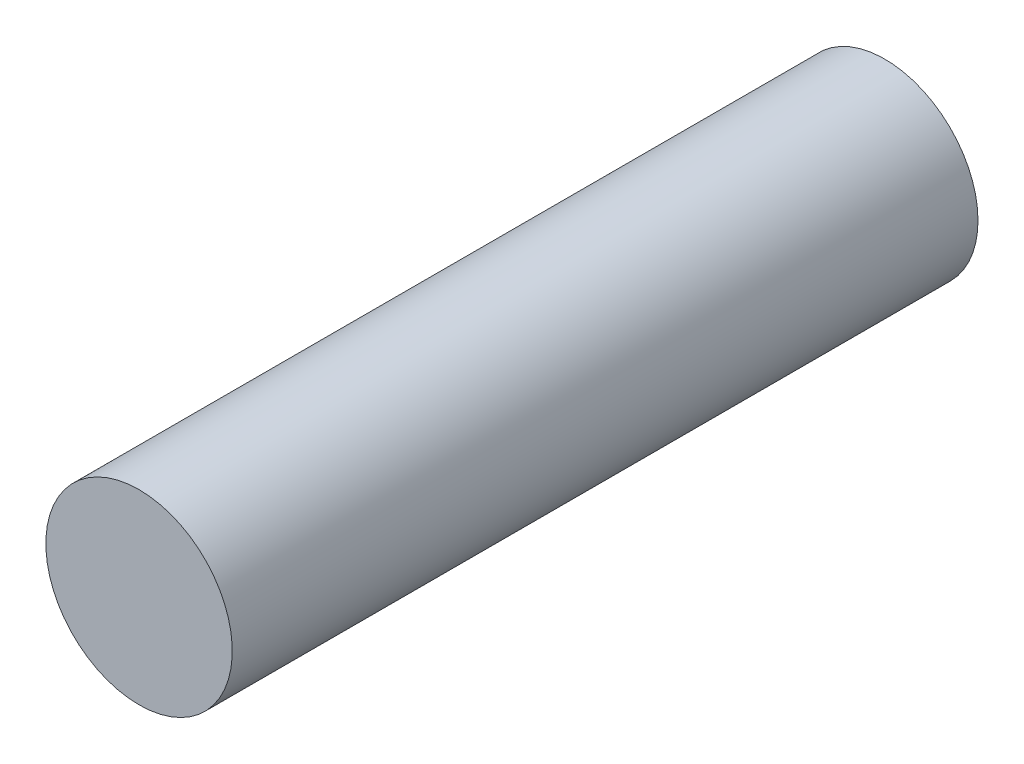
ISO-10303-21;
HEADER;
FILE_DESCRIPTION(('STEP AP214'),'2;1');
FILE_NAME('part.step','',(''),(''),'','','');
FILE_SCHEMA(('AUTOMOTIVE_DESIGN { 1 0 10303 214 1 1 1 1 }'));
ENDSEC;
DATA;
#1=APPLICATION_CONTEXT('core data for automotive mechanical design processes');
#2=APPLICATION_PROTOCOL_DEFINITION('international standard','automotive_design',2000,#1);
#3=PRODUCT_CONTEXT('',#1,'mechanical');
#4=PRODUCT('Part','Part','',(#3));
#5=PRODUCT_RELATED_PRODUCT_CATEGORY('part','',(#4));
#6=PRODUCT_DEFINITION_FORMATION('','',#4);
#7=PRODUCT_DEFINITION_CONTEXT('part definition',#1,'design');
#8=PRODUCT_DEFINITION('design','',#6,#7);
#9=PRODUCT_DEFINITION_SHAPE('','',#8);
#10=(LENGTH_UNIT() NAMED_UNIT(*) SI_UNIT(.MILLI.,.METRE.));
#11=(NAMED_UNIT(*) PLANE_ANGLE_UNIT() SI_UNIT($,.RADIAN.));
#12=(NAMED_UNIT(*) SI_UNIT($,.STERADIAN.) SOLID_ANGLE_UNIT());
#13=UNCERTAINTY_MEASURE_WITH_UNIT(LENGTH_MEASURE(1.E-05),#10,'distance_accuracy_value','');
#14=(GEOMETRIC_REPRESENTATION_CONTEXT(3) GLOBAL_UNCERTAINTY_ASSIGNED_CONTEXT((#13)) GLOBAL_UNIT_ASSIGNED_CONTEXT((#10,
#11,#12)) REPRESENTATION_CONTEXT('',''));
#15=CARTESIAN_POINT('',(0.,0.,0.));
#16=DIRECTION('',(0.,0.,1.));
#17=DIRECTION('',(1.,0.,0.));
#18=AXIS2_PLACEMENT_3D('',#15,#16,#17);
#19=CARTESIAN_POINT('',(0.,0.,3.44842712474394));
#20=DIRECTION('',(0.,0.,-1.));
#21=DIRECTION('',(-1.,0.,0.));
#22=AXIS2_PLACEMENT_3D('',#19,#20,#21);
#23=CYLINDRICAL_SURFACE('',#22,1.);
#24=CARTESIAN_POINT('',(0.,0.,-7.37999999999751));
#25=DIRECTION('',(0.,0.,1.));
#26=DIRECTION('',(1.,0.,0.));
#27=AXIS2_PLACEMENT_3D('',#24,#25,#26);
#28=CIRCLE('',#27,1.);
#29=CARTESIAN_POINT('',(1.,0.,-7.37999999999751));
#30=VERTEX_POINT('',#29);
#31=EDGE_CURVE('E38',#30,#30,#28,.T.);
#32=ORIENTED_EDGE('',*,*,#31,.T.);
#33=EDGE_LOOP('',(#32));
#34=FACE_BOUND('',#33,.T.);
#35=CARTESIAN_POINT('',(0.,0.,0.619999999997746));
#36=DIRECTION('',(0.,0.,1.));
#37=DIRECTION('',(0.,-1.,0.));
#38=AXIS2_PLACEMENT_3D('',#35,#36,#37);
#39=CIRCLE('',#38,1.);
#40=CARTESIAN_POINT('',(0.,-1.,0.619999999997745));
#41=VERTEX_POINT('',#40);
#42=EDGE_CURVE('E10',#41,#41,#39,.T.);
#43=ORIENTED_EDGE('',*,*,#42,.F.);
#44=EDGE_LOOP('',(#43));
#45=FACE_BOUND('',#44,.T.);
#46=ADVANCED_FACE('F31',(#34,#45),#23,.T.);
#47=CARTESIAN_POINT('',(0.,0.,-7.37999999999751));
#48=DIRECTION('',(0.,0.,1.));
#49=DIRECTION('',(1.,0.,0.));
#50=AXIS2_PLACEMENT_3D('',#47,#48,#49);
#51=PLANE('',#50);
#52=ORIENTED_EDGE('',*,*,#31,.F.);
#53=EDGE_LOOP('',(#52));
#54=FACE_BOUND('',#53,.T.);
#55=ADVANCED_FACE('F46',(#54),#51,.F.);
#56=CARTESIAN_POINT('',(3.20113215611138,4.47244373012223,0.61999999999775));
#57=DIRECTION('',(0.,0.,1.));
#58=DIRECTION('',(-0.506289231286811,-0.862363736646556,0.));
#59=AXIS2_PLACEMENT_3D('',#56,#57,#58);
#60=PLANE('',#59);
#61=ORIENTED_EDGE('',*,*,#42,.T.);
#62=EDGE_LOOP('',(#61));
#63=FACE_BOUND('',#62,.T.);
#64=ADVANCED_FACE('F33',(#63),#60,.T.);
#65=CLOSED_SHELL('',(#46,#55,#64));
#66=MANIFOLD_SOLID_BREP('B2',#65);
#67=ADVANCED_BREP_SHAPE_REPRESENTATION('',(#18,#66),#14);
#68=SHAPE_DEFINITION_REPRESENTATION(#9,#67);
ENDSEC;
END-ISO-10303-21;
